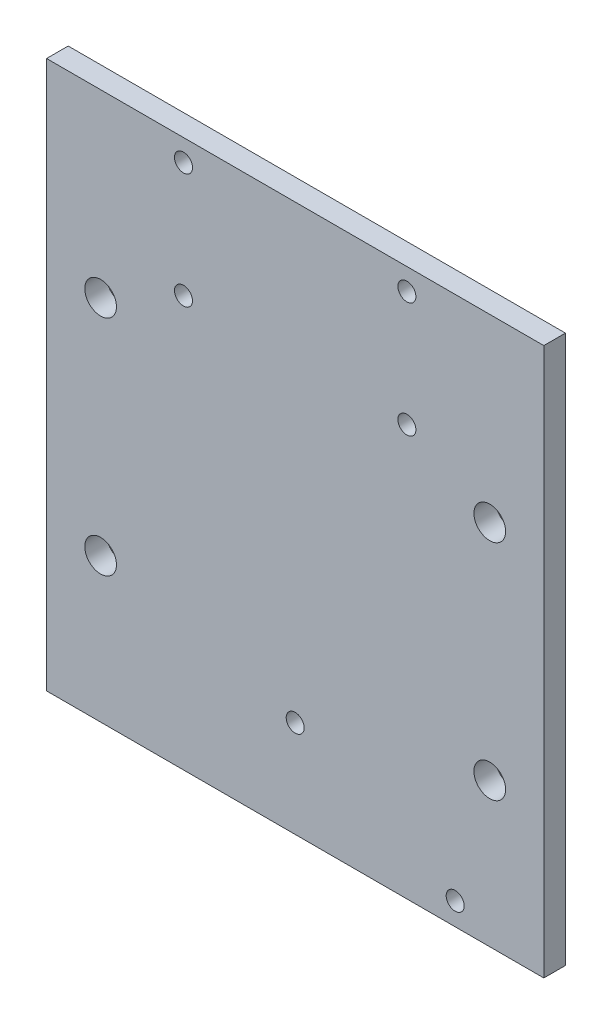
ISO-10303-21;
HEADER;
FILE_DESCRIPTION(('STEP AP214'),'2;1');
FILE_NAME('part.step','',(''),(''),'','','');
FILE_SCHEMA(('AUTOMOTIVE_DESIGN { 1 0 10303 214 1 1 1 1 }'));
ENDSEC;
DATA;
#1=APPLICATION_CONTEXT('core data for automotive mechanical design processes');
#2=APPLICATION_PROTOCOL_DEFINITION('international standard','automotive_design',2000,#1);
#3=PRODUCT_CONTEXT('',#1,'mechanical');
#4=PRODUCT('Part','Part','',(#3));
#5=PRODUCT_RELATED_PRODUCT_CATEGORY('part','',(#4));
#6=PRODUCT_DEFINITION_FORMATION('','',#4);
#7=PRODUCT_DEFINITION_CONTEXT('part definition',#1,'design');
#8=PRODUCT_DEFINITION('design','',#6,#7);
#9=PRODUCT_DEFINITION_SHAPE('','',#8);
#10=(LENGTH_UNIT() NAMED_UNIT(*) SI_UNIT(.MILLI.,.METRE.));
#11=(NAMED_UNIT(*) PLANE_ANGLE_UNIT() SI_UNIT($,.RADIAN.));
#12=(NAMED_UNIT(*) SI_UNIT($,.STERADIAN.) SOLID_ANGLE_UNIT());
#13=UNCERTAINTY_MEASURE_WITH_UNIT(LENGTH_MEASURE(1.E-05),#10,'distance_accuracy_value','');
#14=(GEOMETRIC_REPRESENTATION_CONTEXT(3) GLOBAL_UNCERTAINTY_ASSIGNED_CONTEXT((#13)) GLOBAL_UNIT_ASSIGNED_CONTEXT((#10,
#11,#12)) REPRESENTATION_CONTEXT('',''));
#15=CARTESIAN_POINT('',(0.,0.,0.));
#16=DIRECTION('',(0.,0.,1.));
#17=DIRECTION('',(1.,0.,0.));
#18=AXIS2_PLACEMENT_3D('',#15,#16,#17);
#19=CARTESIAN_POINT('',(34.5,0.,3.));
#20=DIRECTION('',(1.,0.,0.));
#21=DIRECTION('',(0.,1.,0.));
#22=AXIS2_PLACEMENT_3D('',#19,#20,#21);
#23=PLANE('',#22);
#24=DIRECTION('',(0.,-1.,0.));
#25=VECTOR('',#24,1.);
#26=CARTESIAN_POINT('',(34.5,0.,3.));
#27=LINE('',#26,#25);
#28=CARTESIAN_POINT('',(34.5,43.,3.));
#29=VERTEX_POINT('',#28);
#30=CARTESIAN_POINT('',(34.5,-33.,3.));
#31=VERTEX_POINT('',#30);
#32=EDGE_CURVE('E79',#29,#31,#27,.T.);
#33=ORIENTED_EDGE('',*,*,#32,.T.);
#34=DIRECTION('',(0.,0.,1.));
#35=VECTOR('',#34,1.);
#36=CARTESIAN_POINT('',(34.5,-33.,3.));
#37=LINE('',#36,#35);
#38=CARTESIAN_POINT('',(34.5,-33.,0.));
#39=VERTEX_POINT('',#38);
#40=EDGE_CURVE('E82',#39,#31,#37,.T.);
#41=ORIENTED_EDGE('',*,*,#40,.F.);
#42=DIRECTION('',(0.,-1.,0.));
#43=VECTOR('',#42,1.);
#44=CARTESIAN_POINT('',(34.5,0.,0.));
#45=LINE('',#44,#43);
#46=CARTESIAN_POINT('',(34.5,43.,0.));
#47=VERTEX_POINT('',#46);
#48=EDGE_CURVE('E66',#47,#39,#45,.T.);
#49=ORIENTED_EDGE('',*,*,#48,.F.);
#50=DIRECTION('',(0.,0.,-1.));
#51=VECTOR('',#50,1.);
#52=CARTESIAN_POINT('',(34.5,43.,3.));
#53=LINE('',#52,#51);
#54=EDGE_CURVE('E11',#29,#47,#53,.T.);
#55=ORIENTED_EDGE('',*,*,#54,.F.);
#56=EDGE_LOOP('',(#33,#41,#49,#55));
#57=FACE_BOUND('',#56,.T.);
#58=ADVANCED_FACE('F36',(#57),#23,.T.);
#59=CARTESIAN_POINT('',(0.,43.,3.));
#60=DIRECTION('',(0.,1.,0.));
#61=DIRECTION('',(0.,0.,1.));
#62=AXIS2_PLACEMENT_3D('',#59,#60,#61);
#63=PLANE('',#62);
#64=DIRECTION('',(1.,0.,0.));
#65=VECTOR('',#64,1.);
#66=CARTESIAN_POINT('',(0.,43.,0.));
#67=LINE('',#66,#65);
#68=CARTESIAN_POINT('',(-34.5,43.,0.));
#69=VERTEX_POINT('',#68);
#70=EDGE_CURVE('E158',#69,#47,#67,.T.);
#71=ORIENTED_EDGE('',*,*,#70,.F.);
#72=DIRECTION('',(0.,0.,-1.));
#73=VECTOR('',#72,1.);
#74=CARTESIAN_POINT('',(-34.5,43.,3.));
#75=LINE('',#74,#73);
#76=CARTESIAN_POINT('',(-34.5,43.,3.));
#77=VERTEX_POINT('',#76);
#78=EDGE_CURVE('E45',#77,#69,#75,.T.);
#79=ORIENTED_EDGE('',*,*,#78,.F.);
#80=DIRECTION('',(1.,0.,0.));
#81=VECTOR('',#80,1.);
#82=CARTESIAN_POINT('',(0.,43.,3.));
#83=LINE('',#82,#81);
#84=EDGE_CURVE('E85',#77,#29,#83,.T.);
#85=ORIENTED_EDGE('',*,*,#84,.T.);
#86=ORIENTED_EDGE('',*,*,#54,.T.);
#87=EDGE_LOOP('',(#71,#79,#85,#86));
#88=FACE_BOUND('',#87,.T.);
#89=ADVANCED_FACE('F182',(#88),#63,.T.);
#90=CARTESIAN_POINT('',(-34.5,0.,3.));
#91=DIRECTION('',(1.,0.,0.));
#92=DIRECTION('',(0.,1.,0.));
#93=AXIS2_PLACEMENT_3D('',#90,#91,#92);
#94=PLANE('',#93);
#95=DIRECTION('',(0.,-1.,0.));
#96=VECTOR('',#95,1.);
#97=CARTESIAN_POINT('',(-34.5,0.,0.));
#98=LINE('',#97,#96);
#99=CARTESIAN_POINT('',(-34.5,-33.,0.));
#100=VERTEX_POINT('',#99);
#101=EDGE_CURVE('E86',#69,#100,#98,.T.);
#102=ORIENTED_EDGE('',*,*,#101,.T.);
#103=DIRECTION('',(0.,0.,-1.));
#104=VECTOR('',#103,1.);
#105=CARTESIAN_POINT('',(-34.5,-33.,3.));
#106=LINE('',#105,#104);
#107=CARTESIAN_POINT('',(-34.5,-33.,3.));
#108=VERTEX_POINT('',#107);
#109=EDGE_CURVE('E96',#108,#100,#106,.T.);
#110=ORIENTED_EDGE('',*,*,#109,.F.);
#111=DIRECTION('',(0.,-1.,0.));
#112=VECTOR('',#111,1.);
#113=CARTESIAN_POINT('',(-34.5,0.,3.));
#114=LINE('',#113,#112);
#115=EDGE_CURVE('E92',#77,#108,#114,.T.);
#116=ORIENTED_EDGE('',*,*,#115,.F.);
#117=ORIENTED_EDGE('',*,*,#78,.T.);
#118=EDGE_LOOP('',(#102,#110,#116,#117));
#119=FACE_BOUND('',#118,.T.);
#120=ADVANCED_FACE('F186',(#119),#94,.F.);
#121=CARTESIAN_POINT('',(0.,0.,3.));
#122=DIRECTION('',(0.,0.,1.));
#123=DIRECTION('',(1.,0.,0.));
#124=AXIS2_PLACEMENT_3D('',#121,#122,#123);
#125=PLANE('',#124);
#126=CARTESIAN_POINT('',(0.,-19.5746269564373,3.));
#127=DIRECTION('',(0.,0.,1.));
#128=DIRECTION('',(1.,0.,0.));
#129=AXIS2_PLACEMENT_3D('',#126,#127,#128);
#130=CIRCLE('',#129,1.24999999999999);
#131=CARTESIAN_POINT('',(1.24999999999999,-19.5746269564373,3.));
#132=VERTEX_POINT('',#131);
#133=EDGE_CURVE('E417',#132,#132,#130,.T.);
#134=ORIENTED_EDGE('',*,*,#133,.F.);
#135=EDGE_LOOP('',(#134));
#136=FACE_BOUND('',#135,.T.);
#137=CARTESIAN_POINT('',(22.2,-29.8746269564373,3.));
#138=DIRECTION('',(0.,0.,1.));
#139=DIRECTION('',(1.,0.,0.));
#140=AXIS2_PLACEMENT_3D('',#137,#138,#139);
#141=CIRCLE('',#140,1.24999999999999);
#142=CARTESIAN_POINT('',(23.45,-29.8746269564373,3.));
#143=VERTEX_POINT('',#142);
#144=EDGE_CURVE('E103',#143,#143,#141,.T.);
#145=ORIENTED_EDGE('',*,*,#144,.F.);
#146=EDGE_LOOP('',(#145));
#147=FACE_BOUND('',#146,.T.);
#148=ORIENTED_EDGE('',*,*,#115,.T.);
#149=DIRECTION('',(-1.,0.,0.));
#150=VECTOR('',#149,1.);
#151=CARTESIAN_POINT('',(34.5,-33.,3.));
#152=LINE('',#151,#150);
#153=EDGE_CURVE('E89',#31,#108,#152,.T.);
#154=ORIENTED_EDGE('',*,*,#153,.F.);
#155=ORIENTED_EDGE('',*,*,#32,.F.);
#156=ORIENTED_EDGE('',*,*,#84,.F.);
#157=EDGE_LOOP('',(#148,#154,#155,#156));
#158=FACE_BOUND('',#157,.T.);
#159=CARTESIAN_POINT('',(-15.5,24.,3.));
#160=DIRECTION('',(0.,0.,1.));
#161=DIRECTION('',(1.,0.,0.));
#162=AXIS2_PLACEMENT_3D('',#159,#160,#161);
#163=CIRCLE('',#162,1.24999999999999);
#164=CARTESIAN_POINT('',(-14.25,24.,3.));
#165=VERTEX_POINT('',#164);
#166=EDGE_CURVE('E109',#165,#165,#163,.T.);
#167=ORIENTED_EDGE('',*,*,#166,.F.);
#168=EDGE_LOOP('',(#167));
#169=FACE_BOUND('',#168,.T.);
#170=CARTESIAN_POINT('',(15.5,24.,3.));
#171=DIRECTION('',(0.,0.,1.));
#172=DIRECTION('',(1.,0.,0.));
#173=AXIS2_PLACEMENT_3D('',#170,#171,#172);
#174=CIRCLE('',#173,1.24999999999999);
#175=CARTESIAN_POINT('',(16.75,24.,3.));
#176=VERTEX_POINT('',#175);
#177=EDGE_CURVE('E113',#176,#176,#174,.T.);
#178=ORIENTED_EDGE('',*,*,#177,.F.);
#179=EDGE_LOOP('',(#178));
#180=FACE_BOUND('',#179,.T.);
#181=CARTESIAN_POINT('',(-15.5,40.,3.));
#182=DIRECTION('',(0.,0.,1.));
#183=DIRECTION('',(1.,0.,0.));
#184=AXIS2_PLACEMENT_3D('',#181,#182,#183);
#185=CIRCLE('',#184,1.24999999999999);
#186=CARTESIAN_POINT('',(-14.25,40.,3.));
#187=VERTEX_POINT('',#186);
#188=EDGE_CURVE('E119',#187,#187,#185,.T.);
#189=ORIENTED_EDGE('',*,*,#188,.F.);
#190=EDGE_LOOP('',(#189));
#191=FACE_BOUND('',#190,.T.);
#192=CARTESIAN_POINT('',(15.5,40.,3.));
#193=DIRECTION('',(0.,0.,1.));
#194=DIRECTION('',(1.,0.,0.));
#195=AXIS2_PLACEMENT_3D('',#192,#193,#194);
#196=CIRCLE('',#195,1.24999999999999);
#197=CARTESIAN_POINT('',(16.75,40.,3.));
#198=VERTEX_POINT('',#197);
#199=EDGE_CURVE('E125',#198,#198,#196,.T.);
#200=ORIENTED_EDGE('',*,*,#199,.F.);
#201=EDGE_LOOP('',(#200));
#202=FACE_BOUND('',#201,.T.);
#203=CARTESIAN_POINT('',(27.,18.,3.));
#204=DIRECTION('',(0.,0.,1.));
#205=DIRECTION('',(1.,0.,0.));
#206=AXIS2_PLACEMENT_3D('',#203,#204,#205);
#207=CIRCLE('',#206,2.2);
#208=CARTESIAN_POINT('',(29.2,18.,3.));
#209=VERTEX_POINT('',#208);
#210=EDGE_CURVE('E138',#209,#209,#207,.T.);
#211=ORIENTED_EDGE('',*,*,#210,.F.);
#212=EDGE_LOOP('',(#211));
#213=FACE_BOUND('',#212,.T.);
#214=CARTESIAN_POINT('',(-27.,-13.,3.));
#215=DIRECTION('',(0.,0.,1.));
#216=DIRECTION('',(1.,0.,0.));
#217=AXIS2_PLACEMENT_3D('',#214,#215,#216);
#218=CIRCLE('',#217,2.2);
#219=CARTESIAN_POINT('',(-24.8,-13.,3.));
#220=VERTEX_POINT('',#219);
#221=EDGE_CURVE('E145',#220,#220,#218,.T.);
#222=ORIENTED_EDGE('',*,*,#221,.F.);
#223=EDGE_LOOP('',(#222));
#224=FACE_BOUND('',#223,.T.);
#225=CARTESIAN_POINT('',(27.,-13.,3.));
#226=DIRECTION('',(0.,0.,1.));
#227=DIRECTION('',(1.,0.,0.));
#228=AXIS2_PLACEMENT_3D('',#225,#226,#227);
#229=CIRCLE('',#228,2.2);
#230=CARTESIAN_POINT('',(29.2,-13.,3.));
#231=VERTEX_POINT('',#230);
#232=EDGE_CURVE('E132',#231,#231,#229,.T.);
#233=ORIENTED_EDGE('',*,*,#232,.F.);
#234=EDGE_LOOP('',(#233));
#235=FACE_BOUND('',#234,.T.);
#236=CARTESIAN_POINT('',(-27.,18.,3.));
#237=DIRECTION('',(0.,0.,1.));
#238=DIRECTION('',(1.,0.,0.));
#239=AXIS2_PLACEMENT_3D('',#236,#237,#238);
#240=CIRCLE('',#239,2.2);
#241=CARTESIAN_POINT('',(-24.8,18.,3.));
#242=VERTEX_POINT('',#241);
#243=EDGE_CURVE('E141',#242,#242,#240,.T.);
#244=ORIENTED_EDGE('',*,*,#243,.F.);
#245=EDGE_LOOP('',(#244));
#246=FACE_BOUND('',#245,.T.);
#247=ADVANCED_FACE('F90',(#136,#147,#158,#169,#180,#191,#202,#213,#224,#235,#246),#125,.T.);
#248=CARTESIAN_POINT('',(0.,0.,0.));
#249=DIRECTION('',(0.,0.,1.));
#250=DIRECTION('',(1.,0.,0.));
#251=AXIS2_PLACEMENT_3D('',#248,#249,#250);
#252=PLANE('',#251);
#253=CARTESIAN_POINT('',(0.,-19.5746269564373,0.));
#254=DIRECTION('',(0.,0.,1.));
#255=DIRECTION('',(1.,0.,0.));
#256=AXIS2_PLACEMENT_3D('',#253,#254,#255);
#257=CIRCLE('',#256,1.24999999999999);
#258=CARTESIAN_POINT('',(1.24999999999999,-19.5746269564373,0.));
#259=VERTEX_POINT('',#258);
#260=EDGE_CURVE('E39',#259,#259,#257,.T.);
#261=ORIENTED_EDGE('',*,*,#260,.T.);
#262=EDGE_LOOP('',(#261));
#263=FACE_BOUND('',#262,.T.);
#264=CARTESIAN_POINT('',(22.2,-29.8746269564373,0.));
#265=DIRECTION('',(0.,0.,1.));
#266=DIRECTION('',(1.,0.,0.));
#267=AXIS2_PLACEMENT_3D('',#264,#265,#266);
#268=CIRCLE('',#267,1.24999999999999);
#269=CARTESIAN_POINT('',(23.45,-29.8746269564373,0.));
#270=VERTEX_POINT('',#269);
#271=EDGE_CURVE('E100',#270,#270,#268,.T.);
#272=ORIENTED_EDGE('',*,*,#271,.T.);
#273=EDGE_LOOP('',(#272));
#274=FACE_BOUND('',#273,.T.);
#275=CARTESIAN_POINT('',(-15.5,24.,0.));
#276=DIRECTION('',(0.,0.,1.));
#277=DIRECTION('',(1.,0.,0.));
#278=AXIS2_PLACEMENT_3D('',#275,#276,#277);
#279=CIRCLE('',#278,1.24999999999999);
#280=CARTESIAN_POINT('',(-14.25,24.,0.));
#281=VERTEX_POINT('',#280);
#282=EDGE_CURVE('E112',#281,#281,#279,.T.);
#283=ORIENTED_EDGE('',*,*,#282,.T.);
#284=EDGE_LOOP('',(#283));
#285=FACE_BOUND('',#284,.T.);
#286=CARTESIAN_POINT('',(15.5,24.,0.));
#287=DIRECTION('',(0.,0.,1.));
#288=DIRECTION('',(1.,0.,0.));
#289=AXIS2_PLACEMENT_3D('',#286,#287,#288);
#290=CIRCLE('',#289,1.24999999999999);
#291=CARTESIAN_POINT('',(16.75,24.,0.));
#292=VERTEX_POINT('',#291);
#293=EDGE_CURVE('E116',#292,#292,#290,.T.);
#294=ORIENTED_EDGE('',*,*,#293,.T.);
#295=EDGE_LOOP('',(#294));
#296=FACE_BOUND('',#295,.T.);
#297=CARTESIAN_POINT('',(-15.5,40.,0.));
#298=DIRECTION('',(0.,0.,1.));
#299=DIRECTION('',(1.,0.,0.));
#300=AXIS2_PLACEMENT_3D('',#297,#298,#299);
#301=CIRCLE('',#300,1.24999999999999);
#302=CARTESIAN_POINT('',(-14.25,40.,0.));
#303=VERTEX_POINT('',#302);
#304=EDGE_CURVE('E122',#303,#303,#301,.T.);
#305=ORIENTED_EDGE('',*,*,#304,.T.);
#306=EDGE_LOOP('',(#305));
#307=FACE_BOUND('',#306,.T.);
#308=CARTESIAN_POINT('',(15.5,40.,0.));
#309=DIRECTION('',(0.,0.,1.));
#310=DIRECTION('',(1.,0.,0.));
#311=AXIS2_PLACEMENT_3D('',#308,#309,#310);
#312=CIRCLE('',#311,1.24999999999999);
#313=CARTESIAN_POINT('',(16.75,40.,0.));
#314=VERTEX_POINT('',#313);
#315=EDGE_CURVE('E128',#314,#314,#312,.T.);
#316=ORIENTED_EDGE('',*,*,#315,.T.);
#317=EDGE_LOOP('',(#316));
#318=FACE_BOUND('',#317,.T.);
#319=CARTESIAN_POINT('',(27.,18.,0.));
#320=DIRECTION('',(0.,0.,1.));
#321=DIRECTION('',(1.,0.,0.));
#322=AXIS2_PLACEMENT_3D('',#319,#320,#321);
#323=CIRCLE('',#322,2.2);
#324=CARTESIAN_POINT('',(29.2,18.,0.));
#325=VERTEX_POINT('',#324);
#326=EDGE_CURVE('E142',#325,#325,#323,.T.);
#327=ORIENTED_EDGE('',*,*,#326,.T.);
#328=EDGE_LOOP('',(#327));
#329=FACE_BOUND('',#328,.T.);
#330=CARTESIAN_POINT('',(-27.,-13.,0.));
#331=DIRECTION('',(0.,0.,1.));
#332=DIRECTION('',(1.,0.,0.));
#333=AXIS2_PLACEMENT_3D('',#330,#331,#332);
#334=CIRCLE('',#333,2.2);
#335=CARTESIAN_POINT('',(-24.8,-13.,0.));
#336=VERTEX_POINT('',#335);
#337=EDGE_CURVE('E135',#336,#336,#334,.T.);
#338=ORIENTED_EDGE('',*,*,#337,.T.);
#339=EDGE_LOOP('',(#338));
#340=FACE_BOUND('',#339,.T.);
#341=CARTESIAN_POINT('',(27.,-13.,0.));
#342=DIRECTION('',(0.,0.,1.));
#343=DIRECTION('',(1.,0.,0.));
#344=AXIS2_PLACEMENT_3D('',#341,#342,#343);
#345=CIRCLE('',#344,2.2);
#346=CARTESIAN_POINT('',(29.2,-13.,0.));
#347=VERTEX_POINT('',#346);
#348=EDGE_CURVE('E131',#347,#347,#345,.T.);
#349=ORIENTED_EDGE('',*,*,#348,.T.);
#350=EDGE_LOOP('',(#349));
#351=FACE_BOUND('',#350,.T.);
#352=CARTESIAN_POINT('',(-27.,18.,0.));
#353=DIRECTION('',(0.,0.,1.));
#354=DIRECTION('',(1.,0.,0.));
#355=AXIS2_PLACEMENT_3D('',#352,#353,#354);
#356=CIRCLE('',#355,2.2);
#357=CARTESIAN_POINT('',(-24.8,18.,0.));
#358=VERTEX_POINT('',#357);
#359=EDGE_CURVE('E150',#358,#358,#356,.T.);
#360=ORIENTED_EDGE('',*,*,#359,.T.);
#361=EDGE_LOOP('',(#360));
#362=FACE_BOUND('',#361,.T.);
#363=ORIENTED_EDGE('',*,*,#48,.T.);
#364=DIRECTION('',(1.,0.,0.));
#365=VECTOR('',#364,1.);
#366=CARTESIAN_POINT('',(34.5,-33.,0.));
#367=LINE('',#366,#365);
#368=EDGE_CURVE('E99',#100,#39,#367,.T.);
#369=ORIENTED_EDGE('',*,*,#368,.F.);
#370=ORIENTED_EDGE('',*,*,#101,.F.);
#371=ORIENTED_EDGE('',*,*,#70,.T.);
#372=EDGE_LOOP('',(#363,#369,#370,#371));
#373=FACE_BOUND('',#372,.T.);
#374=ADVANCED_FACE('F164',(#263,#274,#285,#296,#307,#318,#329,#340,#351,#362,#373),#252,.F.);
#375=CARTESIAN_POINT('',(-27.,18.,0.));
#376=DIRECTION('',(0.,0.,1.));
#377=DIRECTION('',(1.,0.,0.));
#378=AXIS2_PLACEMENT_3D('',#375,#376,#377);
#379=CYLINDRICAL_SURFACE('',#378,2.2);
#380=ORIENTED_EDGE('',*,*,#359,.F.);
#381=EDGE_LOOP('',(#380));
#382=FACE_BOUND('',#381,.T.);
#383=ORIENTED_EDGE('',*,*,#243,.T.);
#384=EDGE_LOOP('',(#383));
#385=FACE_BOUND('',#384,.T.);
#386=ADVANCED_FACE('F195',(#382,#385),#379,.F.);
#387=CARTESIAN_POINT('',(27.,-13.,0.));
#388=DIRECTION('',(0.,0.,1.));
#389=DIRECTION('',(1.,0.,0.));
#390=AXIS2_PLACEMENT_3D('',#387,#388,#389);
#391=CYLINDRICAL_SURFACE('',#390,2.2);
#392=ORIENTED_EDGE('',*,*,#348,.F.);
#393=EDGE_LOOP('',(#392));
#394=FACE_BOUND('',#393,.T.);
#395=ORIENTED_EDGE('',*,*,#232,.T.);
#396=EDGE_LOOP('',(#395));
#397=FACE_BOUND('',#396,.T.);
#398=ADVANCED_FACE('F202',(#394,#397),#391,.F.);
#399=CARTESIAN_POINT('',(-27.,-13.,0.));
#400=DIRECTION('',(0.,0.,1.));
#401=DIRECTION('',(1.,0.,0.));
#402=AXIS2_PLACEMENT_3D('',#399,#400,#401);
#403=CYLINDRICAL_SURFACE('',#402,2.2);
#404=ORIENTED_EDGE('',*,*,#337,.F.);
#405=EDGE_LOOP('',(#404));
#406=FACE_BOUND('',#405,.T.);
#407=ORIENTED_EDGE('',*,*,#221,.T.);
#408=EDGE_LOOP('',(#407));
#409=FACE_BOUND('',#408,.T.);
#410=ADVANCED_FACE('F204',(#406,#409),#403,.F.);
#411=CARTESIAN_POINT('',(27.,18.,0.));
#412=DIRECTION('',(0.,0.,1.));
#413=DIRECTION('',(1.,0.,0.));
#414=AXIS2_PLACEMENT_3D('',#411,#412,#413);
#415=CYLINDRICAL_SURFACE('',#414,2.2);
#416=ORIENTED_EDGE('',*,*,#326,.F.);
#417=EDGE_LOOP('',(#416));
#418=FACE_BOUND('',#417,.T.);
#419=ORIENTED_EDGE('',*,*,#210,.T.);
#420=EDGE_LOOP('',(#419));
#421=FACE_BOUND('',#420,.T.);
#422=ADVANCED_FACE('F207',(#418,#421),#415,.F.);
#423=CARTESIAN_POINT('',(15.5,40.,3.));
#424=DIRECTION('',(0.,0.,1.));
#425=DIRECTION('',(1.,0.,0.));
#426=AXIS2_PLACEMENT_3D('',#423,#424,#425);
#427=CYLINDRICAL_SURFACE('',#426,1.24999999999999);
#428=ORIENTED_EDGE('',*,*,#199,.T.);
#429=EDGE_LOOP('',(#428));
#430=FACE_BOUND('',#429,.T.);
#431=ORIENTED_EDGE('',*,*,#315,.F.);
#432=EDGE_LOOP('',(#431));
#433=FACE_BOUND('',#432,.T.);
#434=ADVANCED_FACE('F211',(#430,#433),#427,.F.);
#435=CARTESIAN_POINT('',(-15.5,40.,3.));
#436=DIRECTION('',(0.,0.,1.));
#437=DIRECTION('',(1.,0.,0.));
#438=AXIS2_PLACEMENT_3D('',#435,#436,#437);
#439=CYLINDRICAL_SURFACE('',#438,1.24999999999999);
#440=ORIENTED_EDGE('',*,*,#188,.T.);
#441=EDGE_LOOP('',(#440));
#442=FACE_BOUND('',#441,.T.);
#443=ORIENTED_EDGE('',*,*,#304,.F.);
#444=EDGE_LOOP('',(#443));
#445=FACE_BOUND('',#444,.T.);
#446=ADVANCED_FACE('F178',(#442,#445),#439,.F.);
#447=CARTESIAN_POINT('',(15.5,24.,3.));
#448=DIRECTION('',(0.,0.,1.));
#449=DIRECTION('',(1.,0.,0.));
#450=AXIS2_PLACEMENT_3D('',#447,#448,#449);
#451=CYLINDRICAL_SURFACE('',#450,1.24999999999999);
#452=ORIENTED_EDGE('',*,*,#177,.T.);
#453=EDGE_LOOP('',(#452));
#454=FACE_BOUND('',#453,.T.);
#455=ORIENTED_EDGE('',*,*,#293,.F.);
#456=EDGE_LOOP('',(#455));
#457=FACE_BOUND('',#456,.T.);
#458=ADVANCED_FACE('F169',(#454,#457),#451,.F.);
#459=CARTESIAN_POINT('',(-15.5,24.,3.));
#460=DIRECTION('',(0.,0.,1.));
#461=DIRECTION('',(1.,0.,0.));
#462=AXIS2_PLACEMENT_3D('',#459,#460,#461);
#463=CYLINDRICAL_SURFACE('',#462,1.24999999999999);
#464=ORIENTED_EDGE('',*,*,#166,.T.);
#465=EDGE_LOOP('',(#464));
#466=FACE_BOUND('',#465,.T.);
#467=ORIENTED_EDGE('',*,*,#282,.F.);
#468=EDGE_LOOP('',(#467));
#469=FACE_BOUND('',#468,.T.);
#470=ADVANCED_FACE('F167',(#466,#469),#463,.F.);
#471=CARTESIAN_POINT('',(0.,-33.,0.));
#472=DIRECTION('',(0.,1.,0.));
#473=DIRECTION('',(0.,0.,1.));
#474=AXIS2_PLACEMENT_3D('',#471,#472,#473);
#475=PLANE('',#474);
#476=ORIENTED_EDGE('',*,*,#40,.T.);
#477=ORIENTED_EDGE('',*,*,#153,.T.);
#478=ORIENTED_EDGE('',*,*,#109,.T.);
#479=ORIENTED_EDGE('',*,*,#368,.T.);
#480=EDGE_LOOP('',(#476,#477,#478,#479));
#481=FACE_BOUND('',#480,.T.);
#482=ADVANCED_FACE('F98',(#481),#475,.F.);
#483=CARTESIAN_POINT('',(22.2,-29.8746269564373,3.));
#484=DIRECTION('',(0.,0.,1.));
#485=DIRECTION('',(1.,0.,0.));
#486=AXIS2_PLACEMENT_3D('',#483,#484,#485);
#487=CYLINDRICAL_SURFACE('',#486,1.24999999999999);
#488=ORIENTED_EDGE('',*,*,#144,.T.);
#489=EDGE_LOOP('',(#488));
#490=FACE_BOUND('',#489,.T.);
#491=ORIENTED_EDGE('',*,*,#271,.F.);
#492=EDGE_LOOP('',(#491));
#493=FACE_BOUND('',#492,.T.);
#494=ADVANCED_FACE('F176',(#490,#493),#487,.F.);
#495=CARTESIAN_POINT('',(0.,-19.5746269564373,3.));
#496=DIRECTION('',(0.,0.,1.));
#497=DIRECTION('',(1.,0.,0.));
#498=AXIS2_PLACEMENT_3D('',#495,#496,#497);
#499=CYLINDRICAL_SURFACE('',#498,1.24999999999999);
#500=ORIENTED_EDGE('',*,*,#133,.T.);
#501=EDGE_LOOP('',(#500));
#502=FACE_BOUND('',#501,.T.);
#503=ORIENTED_EDGE('',*,*,#260,.F.);
#504=EDGE_LOOP('',(#503));
#505=FACE_BOUND('',#504,.T.);
#506=ADVANCED_FACE('F307',(#502,#505),#499,.F.);
#507=CLOSED_SHELL('',(#58,#89,#120,#247,#374,#386,#398,#410,#422,#434,#446,#458,#470,#482,#494,#506));
#508=MANIFOLD_SOLID_BREP('B2',#507);
#509=ADVANCED_BREP_SHAPE_REPRESENTATION('',(#18,#508),#14);
#510=SHAPE_DEFINITION_REPRESENTATION(#9,#509);
ENDSEC;
END-ISO-10303-21;
